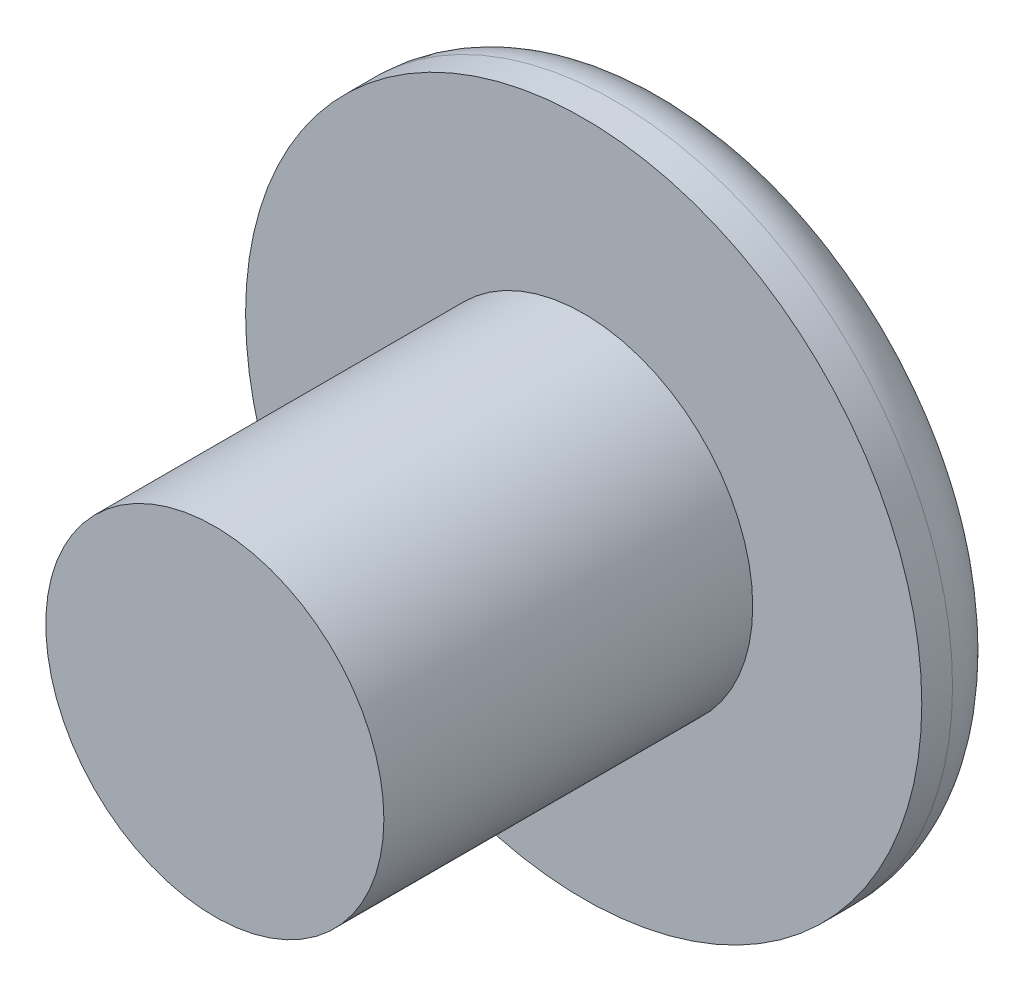
ISO-10303-21;
HEADER;
FILE_DESCRIPTION(('STEP AP214'),'2;1');
FILE_NAME('part.step','',(''),(''),'','','');
FILE_SCHEMA(('AUTOMOTIVE_DESIGN { 1 0 10303 214 1 1 1 1 }'));
ENDSEC;
DATA;
#1=APPLICATION_CONTEXT('core data for automotive mechanical design processes');
#2=APPLICATION_PROTOCOL_DEFINITION('international standard','automotive_design',2000,#1);
#3=PRODUCT_CONTEXT('',#1,'mechanical');
#4=PRODUCT('Part','Part','',(#3));
#5=PRODUCT_RELATED_PRODUCT_CATEGORY('part','',(#4));
#6=PRODUCT_DEFINITION_FORMATION('','',#4);
#7=PRODUCT_DEFINITION_CONTEXT('part definition',#1,'design');
#8=PRODUCT_DEFINITION('design','',#6,#7);
#9=PRODUCT_DEFINITION_SHAPE('','',#8);
#10=(LENGTH_UNIT() NAMED_UNIT(*) SI_UNIT(.MILLI.,.METRE.));
#11=(NAMED_UNIT(*) PLANE_ANGLE_UNIT() SI_UNIT($,.RADIAN.));
#12=(NAMED_UNIT(*) SI_UNIT($,.STERADIAN.) SOLID_ANGLE_UNIT());
#13=UNCERTAINTY_MEASURE_WITH_UNIT(LENGTH_MEASURE(1.E-05),#10,'distance_accuracy_value','');
#14=(GEOMETRIC_REPRESENTATION_CONTEXT(3) GLOBAL_UNCERTAINTY_ASSIGNED_CONTEXT((#13)) GLOBAL_UNIT_ASSIGNED_CONTEXT((#10,
#11,#12)) REPRESENTATION_CONTEXT('',''));
#15=CARTESIAN_POINT('',(0.,0.,0.));
#16=DIRECTION('',(0.,0.,1.));
#17=DIRECTION('',(1.,0.,0.));
#18=AXIS2_PLACEMENT_3D('',#15,#16,#17);
#19=CARTESIAN_POINT('',(0.,0.,3.));
#20=DIRECTION('',(0.,0.,-1.));
#21=DIRECTION('',(-1.,0.,0.));
#22=AXIS2_PLACEMENT_3D('',#19,#20,#21);
#23=CYLINDRICAL_SURFACE('',#22,11.);
#24=CARTESIAN_POINT('',(0.,0.,2.));
#25=DIRECTION('',(0.,0.,1.));
#26=DIRECTION('',(1.,0.,0.));
#27=AXIS2_PLACEMENT_3D('',#24,#25,#26);
#28=CIRCLE('',#27,11.);
#29=CARTESIAN_POINT('',(11.,0.,2.));
#30=VERTEX_POINT('',#29);
#31=EDGE_CURVE('E49',#30,#30,#28,.T.);
#32=ORIENTED_EDGE('',*,*,#31,.T.);
#33=EDGE_LOOP('',(#32));
#34=FACE_BOUND('',#33,.T.);
#35=CARTESIAN_POINT('',(0.,0.,3.));
#36=DIRECTION('',(0.,0.,1.));
#37=DIRECTION('',(1.,0.,0.));
#38=AXIS2_PLACEMENT_3D('',#35,#36,#37);
#39=CIRCLE('',#38,11.);
#40=CARTESIAN_POINT('',(11.,0.,3.));
#41=VERTEX_POINT('',#40);
#42=EDGE_CURVE('E61',#41,#41,#39,.T.);
#43=ORIENTED_EDGE('',*,*,#42,.F.);
#44=EDGE_LOOP('',(#43));
#45=FACE_BOUND('',#44,.T.);
#46=ADVANCED_FACE('F41',(#34,#45),#23,.T.);
#47=CARTESIAN_POINT('',(0.,0.,3.));
#48=DIRECTION('',(0.,0.,1.));
#49=DIRECTION('',(1.,0.,0.));
#50=AXIS2_PLACEMENT_3D('',#47,#48,#49);
#51=PLANE('',#50);
#52=CARTESIAN_POINT('',(0.,0.,3.));
#53=DIRECTION('',(0.,0.,1.));
#54=DIRECTION('',(1.,0.,0.));
#55=AXIS2_PLACEMENT_3D('',#52,#53,#54);
#56=CIRCLE('',#55,5.5);
#57=CARTESIAN_POINT('',(5.5,0.,3.));
#58=VERTEX_POINT('',#57);
#59=EDGE_CURVE('E56',#58,#58,#56,.T.);
#60=ORIENTED_EDGE('',*,*,#59,.F.);
#61=EDGE_LOOP('',(#60));
#62=FACE_BOUND('',#61,.T.);
#63=ORIENTED_EDGE('',*,*,#42,.T.);
#64=EDGE_LOOP('',(#63));
#65=FACE_BOUND('',#64,.T.);
#66=ADVANCED_FACE('F79',(#62,#65),#51,.T.);
#67=CARTESIAN_POINT('',(0.,0.,0.));
#68=DIRECTION('',(0.,0.,1.));
#69=DIRECTION('',(1.,0.,0.));
#70=AXIS2_PLACEMENT_3D('',#67,#68,#69);
#71=PLANE('',#70);
#72=CARTESIAN_POINT('',(0.,0.,0.));
#73=DIRECTION('',(0.,0.,1.));
#74=DIRECTION('',(1.,0.,0.));
#75=AXIS2_PLACEMENT_3D('',#72,#73,#74);
#76=CIRCLE('',#75,9.);
#77=CARTESIAN_POINT('',(9.,0.,0.));
#78=VERTEX_POINT('',#77);
#79=EDGE_CURVE('E10',#78,#78,#76,.F.);
#80=ORIENTED_EDGE('',*,*,#79,.T.);
#81=EDGE_LOOP('',(#80));
#82=FACE_BOUND('',#81,.T.);
#83=ADVANCED_FACE('F75',(#82),#71,.F.);
#84=CARTESIAN_POINT('',(0.,0.,15.));
#85=DIRECTION('',(0.,0.,-1.));
#86=DIRECTION('',(-1.,0.,0.));
#87=AXIS2_PLACEMENT_3D('',#84,#85,#86);
#88=CYLINDRICAL_SURFACE('',#87,5.5);
#89=CARTESIAN_POINT('',(0.,0.,15.));
#90=DIRECTION('',(0.,0.,1.));
#91=DIRECTION('',(1.,0.,0.));
#92=AXIS2_PLACEMENT_3D('',#89,#90,#91);
#93=CIRCLE('',#92,5.5);
#94=CARTESIAN_POINT('',(5.5,0.,15.));
#95=VERTEX_POINT('',#94);
#96=EDGE_CURVE('E65',#95,#95,#93,.T.);
#97=ORIENTED_EDGE('',*,*,#96,.F.);
#98=EDGE_LOOP('',(#97));
#99=FACE_BOUND('',#98,.T.);
#100=ORIENTED_EDGE('',*,*,#59,.T.);
#101=EDGE_LOOP('',(#100));
#102=FACE_BOUND('',#101,.T.);
#103=ADVANCED_FACE('F72',(#99,#102),#88,.T.);
#104=CARTESIAN_POINT('',(0.,0.,15.));
#105=DIRECTION('',(0.,0.,1.));
#106=DIRECTION('',(1.,0.,0.));
#107=AXIS2_PLACEMENT_3D('',#104,#105,#106);
#108=PLANE('',#107);
#109=ORIENTED_EDGE('',*,*,#96,.T.);
#110=EDGE_LOOP('',(#109));
#111=FACE_BOUND('',#110,.T.);
#112=ADVANCED_FACE('F70',(#111),#108,.T.);
#113=CARTESIAN_POINT('',(0.,0.,2.));
#114=DIRECTION('',(0.,0.,1.));
#115=DIRECTION('',(1.,0.,0.));
#116=AXIS2_PLACEMENT_3D('',#113,#114,#115);
#117=TOROIDAL_SURFACE('',#116,9.,2.);
#118=ORIENTED_EDGE('',*,*,#79,.F.);
#119=EDGE_LOOP('',(#118));
#120=FACE_BOUND('',#119,.T.);
#121=ORIENTED_EDGE('',*,*,#31,.F.);
#122=EDGE_LOOP('',(#121));
#123=FACE_BOUND('',#122,.T.);
#124=ADVANCED_FACE('F43',(#120,#123),#117,.T.);
#125=CLOSED_SHELL('',(#46,#66,#83,#103,#112,#124));
#126=MANIFOLD_SOLID_BREP('B2',#125);
#127=ADVANCED_BREP_SHAPE_REPRESENTATION('',(#18,#126),#14);
#128=SHAPE_DEFINITION_REPRESENTATION(#9,#127);
ENDSEC;
END-ISO-10303-21;
